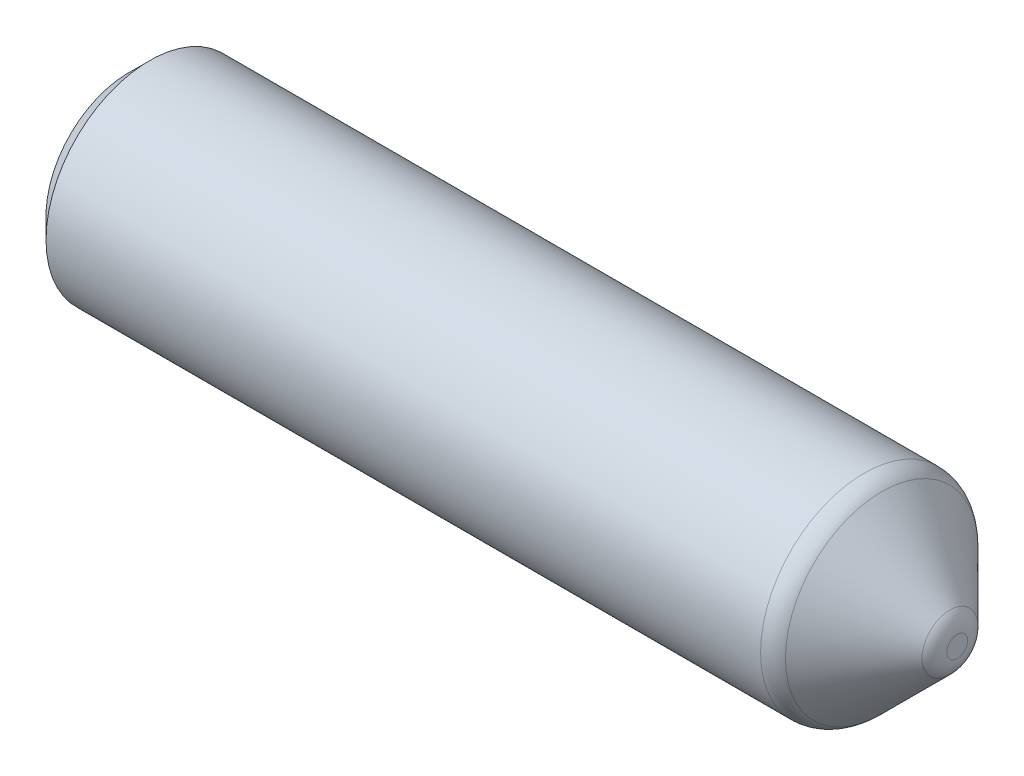
ISO-10303-21;
HEADER;
FILE_DESCRIPTION(('STEP AP214'),'2;1');
FILE_NAME('part.step','',(''),(''),'','','');
FILE_SCHEMA(('AUTOMOTIVE_DESIGN { 1 0 10303 214 1 1 1 1 }'));
ENDSEC;
DATA;
#1=APPLICATION_CONTEXT('core data for automotive mechanical design processes');
#2=APPLICATION_PROTOCOL_DEFINITION('international standard','automotive_design',2000,#1);
#3=PRODUCT_CONTEXT('',#1,'mechanical');
#4=PRODUCT('Part','Part','',(#3));
#5=PRODUCT_RELATED_PRODUCT_CATEGORY('part','',(#4));
#6=PRODUCT_DEFINITION_FORMATION('','',#4);
#7=PRODUCT_DEFINITION_CONTEXT('part definition',#1,'design');
#8=PRODUCT_DEFINITION('design','',#6,#7);
#9=PRODUCT_DEFINITION_SHAPE('','',#8);
#10=(LENGTH_UNIT() NAMED_UNIT(*) SI_UNIT(.MILLI.,.METRE.));
#11=(NAMED_UNIT(*) PLANE_ANGLE_UNIT() SI_UNIT($,.RADIAN.));
#12=(NAMED_UNIT(*) SI_UNIT($,.STERADIAN.) SOLID_ANGLE_UNIT());
#13=UNCERTAINTY_MEASURE_WITH_UNIT(LENGTH_MEASURE(1.E-05),#10,'distance_accuracy_value','');
#14=(GEOMETRIC_REPRESENTATION_CONTEXT(3) GLOBAL_UNCERTAINTY_ASSIGNED_CONTEXT((#13)) GLOBAL_UNIT_ASSIGNED_CONTEXT((#10,
#11,#12)) REPRESENTATION_CONTEXT('',''));
#15=CARTESIAN_POINT('',(0.,0.,0.));
#16=DIRECTION('',(0.,0.,1.));
#17=DIRECTION('',(1.,0.,0.));
#18=AXIS2_PLACEMENT_3D('',#15,#16,#17);
#19=CARTESIAN_POINT('',(200.,0.,0.));
#20=DIRECTION('',(-1.,0.,0.));
#21=DIRECTION('',(0.,0.,1.));
#22=AXIS2_PLACEMENT_3D('',#19,#20,#21);
#23=CYLINDRICAL_SURFACE('',#22,50.);
#24=CARTESIAN_POINT('',(-190.,0.,0.));
#25=DIRECTION('',(1.,0.,0.));
#26=DIRECTION('',(0.,0.,-1.));
#27=AXIS2_PLACEMENT_3D('',#24,#25,#26);
#28=CIRCLE('',#27,50.);
#29=CARTESIAN_POINT('',(-190.,0.,-50.));
#30=VERTEX_POINT('',#29);
#31=EDGE_CURVE('E51',#30,#30,#28,.T.);
#32=ORIENTED_EDGE('',*,*,#31,.T.);
#33=EDGE_LOOP('',(#32));
#34=FACE_BOUND('',#33,.T.);
#35=CARTESIAN_POINT('',(155.029437251523,0.,0.));
#36=DIRECTION('',(1.,0.,0.));
#37=DIRECTION('',(0.,0.,-1.));
#38=AXIS2_PLACEMENT_3D('',#35,#36,#37);
#39=CIRCLE('',#38,50.);
#40=CARTESIAN_POINT('',(155.029437251523,0.,-50.));
#41=VERTEX_POINT('',#40);
#42=EDGE_CURVE('E59',#41,#41,#39,.F.);
#43=ORIENTED_EDGE('',*,*,#42,.T.);
#44=EDGE_LOOP('',(#43));
#45=FACE_BOUND('',#44,.T.);
#46=ADVANCED_FACE('F44',(#34,#45),#23,.T.);
#47=CARTESIAN_POINT('',(200.,0.,0.));
#48=DIRECTION('',(1.,0.,0.));
#49=DIRECTION('',(0.,0.,-1.));
#50=AXIS2_PLACEMENT_3D('',#47,#48,#49);
#51=PLANE('',#50);
#52=CARTESIAN_POINT('',(200.,0.,0.));
#53=DIRECTION('',(1.,0.,0.));
#54=DIRECTION('',(0.,0.,-1.));
#55=AXIS2_PLACEMENT_3D('',#52,#53,#54);
#56=CIRCLE('',#55,5.0294372515228);
#57=CARTESIAN_POINT('',(200.,0.,-5.0294372515228));
#58=VERTEX_POINT('',#57);
#59=EDGE_CURVE('E67',#58,#58,#56,.T.);
#60=ORIENTED_EDGE('',*,*,#59,.T.);
#61=EDGE_LOOP('',(#60));
#62=FACE_BOUND('',#61,.T.);
#63=ADVANCED_FACE('F71',(#62),#51,.T.);
#64=CARTESIAN_POINT('',(-200.,0.,0.));
#65=DIRECTION('',(1.,0.,0.));
#66=DIRECTION('',(0.,0.,-1.));
#67=AXIS2_PLACEMENT_3D('',#64,#65,#66);
#68=PLANE('',#67);
#69=CARTESIAN_POINT('',(-200.,0.,0.));
#70=DIRECTION('',(1.,0.,0.));
#71=DIRECTION('',(0.,0.,-1.));
#72=AXIS2_PLACEMENT_3D('',#69,#70,#71);
#73=CIRCLE('',#72,39.9999999999999);
#74=CARTESIAN_POINT('',(-200.,0.,-39.9999999999999));
#75=VERTEX_POINT('',#74);
#76=EDGE_CURVE('E12',#75,#75,#73,.F.);
#77=ORIENTED_EDGE('',*,*,#76,.T.);
#78=EDGE_LOOP('',(#77));
#79=FACE_BOUND('',#78,.T.);
#80=ADVANCED_FACE('F84',(#79),#68,.F.);
#81=CARTESIAN_POINT('',(200.,0.,0.));
#82=DIRECTION('',(-1.,0.,0.));
#83=DIRECTION('',(0.,0.,1.));
#84=AXIS2_PLACEMENT_3D('',#81,#82,#83);
#85=CONICAL_SURFACE('',#84,9.99999999999995,0.785398163397447);
#86=CARTESIAN_POINT('',(163.514718625761,0.,0.));
#87=DIRECTION('',(-1.,0.,0.));
#88=DIRECTION('',(0.,0.,1.));
#89=AXIS2_PLACEMENT_3D('',#86,#87,#88);
#90=CIRCLE('',#89,46.4852813742386);
#91=CARTESIAN_POINT('',(163.514718625761,0.,46.4852813742386));
#92=VERTEX_POINT('',#91);
#93=EDGE_CURVE('E55',#92,#92,#90,.F.);
#94=ORIENTED_EDGE('',*,*,#93,.T.);
#95=EDGE_LOOP('',(#94));
#96=FACE_BOUND('',#95,.T.);
#97=CARTESIAN_POINT('',(196.485281374239,0.,0.));
#98=DIRECTION('',(1.,0.,0.));
#99=DIRECTION('',(0.,0.,-1.));
#100=AXIS2_PLACEMENT_3D('',#97,#98,#99);
#101=CIRCLE('',#100,13.5147186257614);
#102=CARTESIAN_POINT('',(196.485281374239,0.,-13.5147186257614));
#103=VERTEX_POINT('',#102);
#104=EDGE_CURVE('E64',#103,#103,#101,.F.);
#105=ORIENTED_EDGE('',*,*,#104,.T.);
#106=EDGE_LOOP('',(#105));
#107=FACE_BOUND('',#106,.T.);
#108=ADVANCED_FACE('F76',(#96,#107),#85,.T.);
#109=CARTESIAN_POINT('',(188.,0.,0.));
#110=DIRECTION('',(1.,0.,0.));
#111=DIRECTION('',(0.,0.,-1.));
#112=AXIS2_PLACEMENT_3D('',#109,#110,#111);
#113=DEGENERATE_TOROIDAL_SURFACE('',#112,5.0294372515228,12.,.T.);
#114=ORIENTED_EDGE('',*,*,#104,.F.);
#115=EDGE_LOOP('',(#114));
#116=FACE_BOUND('',#115,.T.);
#117=ORIENTED_EDGE('',*,*,#59,.F.);
#118=EDGE_LOOP('',(#117));
#119=FACE_BOUND('',#118,.T.);
#120=ADVANCED_FACE('F73',(#116,#119),#113,.T.);
#121=CARTESIAN_POINT('',(155.029437251523,0.,0.));
#122=DIRECTION('',(1.,0.,0.));
#123=DIRECTION('',(0.,0.,-1.));
#124=AXIS2_PLACEMENT_3D('',#121,#122,#123);
#125=TOROIDAL_SURFACE('',#124,38.,12.);
#126=ORIENTED_EDGE('',*,*,#93,.F.);
#127=EDGE_LOOP('',(#126));
#128=FACE_BOUND('',#127,.T.);
#129=ORIENTED_EDGE('',*,*,#42,.F.);
#130=EDGE_LOOP('',(#129));
#131=FACE_BOUND('',#130,.T.);
#132=ADVANCED_FACE('F75',(#128,#131),#125,.T.);
#133=CARTESIAN_POINT('',(-190.,0.,0.));
#134=DIRECTION('',(1.,0.,0.));
#135=DIRECTION('',(0.,0.,-1.));
#136=AXIS2_PLACEMENT_3D('',#133,#134,#135);
#137=CONICAL_SURFACE('',#136,50.,0.785398163397449);
#138=ORIENTED_EDGE('',*,*,#76,.F.);
#139=EDGE_LOOP('',(#138));
#140=FACE_BOUND('',#139,.T.);
#141=ORIENTED_EDGE('',*,*,#31,.F.);
#142=EDGE_LOOP('',(#141));
#143=FACE_BOUND('',#142,.T.);
#144=ADVANCED_FACE('F46',(#140,#143),#137,.T.);
#145=CLOSED_SHELL('',(#46,#63,#80,#108,#120,#132,#144));
#146=MANIFOLD_SOLID_BREP('B2',#145);
#147=ADVANCED_BREP_SHAPE_REPRESENTATION('',(#18,#146),#14);
#148=SHAPE_DEFINITION_REPRESENTATION(#9,#147);
ENDSEC;
END-ISO-10303-21;
